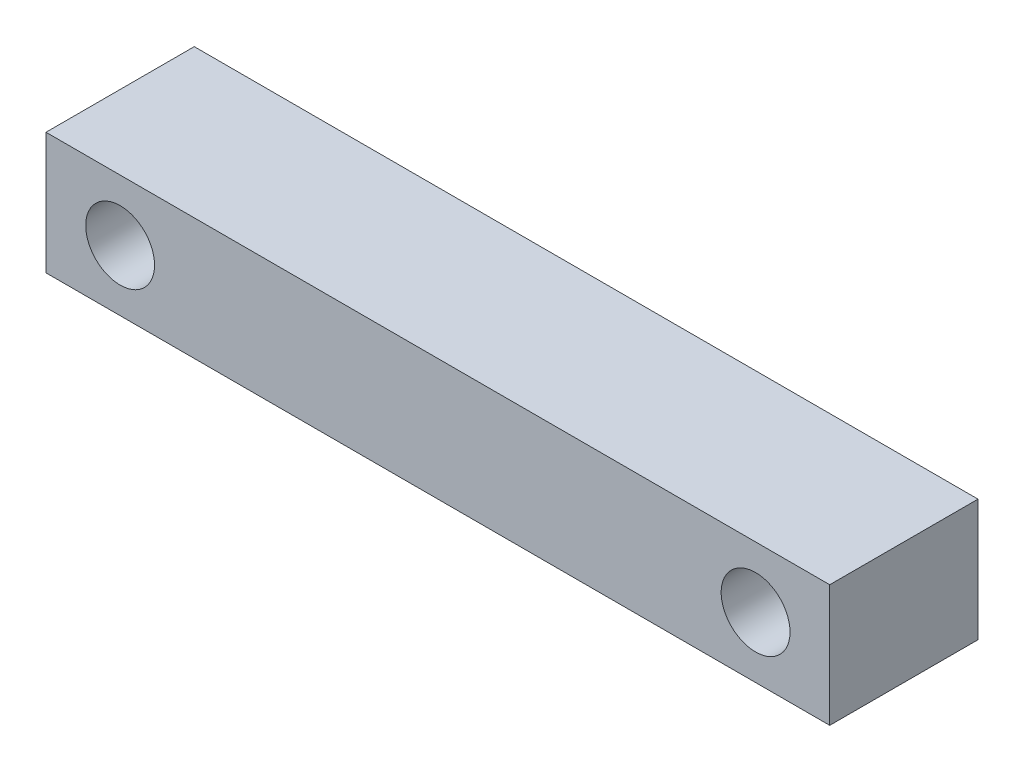
ISO-10303-21;
HEADER;
FILE_DESCRIPTION(('STEP AP214'),'2;1');
FILE_NAME('part.step','',(''),(''),'','','');
FILE_SCHEMA(('AUTOMOTIVE_DESIGN { 1 0 10303 214 1 1 1 1 }'));
ENDSEC;
DATA;
#1=APPLICATION_CONTEXT('core data for automotive mechanical design processes');
#2=APPLICATION_PROTOCOL_DEFINITION('international standard','automotive_design',2000,#1);
#3=PRODUCT_CONTEXT('',#1,'mechanical');
#4=PRODUCT('Part','Part','',(#3));
#5=PRODUCT_RELATED_PRODUCT_CATEGORY('part','',(#4));
#6=PRODUCT_DEFINITION_FORMATION('','',#4);
#7=PRODUCT_DEFINITION_CONTEXT('part definition',#1,'design');
#8=PRODUCT_DEFINITION('design','',#6,#7);
#9=PRODUCT_DEFINITION_SHAPE('','',#8);
#10=(LENGTH_UNIT() NAMED_UNIT(*) SI_UNIT(.MILLI.,.METRE.));
#11=(NAMED_UNIT(*) PLANE_ANGLE_UNIT() SI_UNIT($,.RADIAN.));
#12=(NAMED_UNIT(*) SI_UNIT($,.STERADIAN.) SOLID_ANGLE_UNIT());
#13=UNCERTAINTY_MEASURE_WITH_UNIT(LENGTH_MEASURE(1.E-05),#10,'distance_accuracy_value','');
#14=(GEOMETRIC_REPRESENTATION_CONTEXT(3) GLOBAL_UNCERTAINTY_ASSIGNED_CONTEXT((#13)) GLOBAL_UNIT_ASSIGNED_CONTEXT((#10,
#11,#12)) REPRESENTATION_CONTEXT('',''));
#15=CARTESIAN_POINT('',(0.,0.,0.));
#16=DIRECTION('',(0.,0.,1.));
#17=DIRECTION('',(1.,0.,0.));
#18=AXIS2_PLACEMENT_3D('',#15,#16,#17);
#19=CARTESIAN_POINT('',(-148.,-46.,56.));
#20=DIRECTION('',(0.,0.,1.));
#21=DIRECTION('',(1.,0.,0.));
#22=AXIS2_PLACEMENT_3D('',#19,#20,#21);
#23=PLANE('',#22);
#24=CARTESIAN_POINT('',(-120.,-23.,56.));
#25=DIRECTION('',(0.,0.,1.));
#26=DIRECTION('',(1.,0.,0.));
#27=AXIS2_PLACEMENT_3D('',#24,#25,#26);
#28=CIRCLE('',#27,13.);
#29=CARTESIAN_POINT('',(-107.,-23.,56.));
#30=VERTEX_POINT('',#29);
#31=EDGE_CURVE('E102',#30,#30,#28,.T.);
#32=ORIENTED_EDGE('',*,*,#31,.F.);
#33=EDGE_LOOP('',(#32));
#34=FACE_BOUND('',#33,.T.);
#35=DIRECTION('',(0.,-1.,0.));
#36=VECTOR('',#35,1.);
#37=CARTESIAN_POINT('',(-148.,0.,56.));
#38=LINE('',#37,#36);
#39=CARTESIAN_POINT('',(-148.,0.,56.));
#40=VERTEX_POINT('',#39);
#41=CARTESIAN_POINT('',(-148.,-46.,56.));
#42=VERTEX_POINT('',#41);
#43=EDGE_CURVE('E87',#40,#42,#38,.T.);
#44=ORIENTED_EDGE('',*,*,#43,.T.);
#45=DIRECTION('',(1.,0.,0.));
#46=VECTOR('',#45,1.);
#47=CARTESIAN_POINT('',(-148.,-46.,56.));
#48=LINE('',#47,#46);
#49=CARTESIAN_POINT('',(148.,-46.,56.));
#50=VERTEX_POINT('',#49);
#51=EDGE_CURVE('E82',#42,#50,#48,.T.);
#52=ORIENTED_EDGE('',*,*,#51,.T.);
#53=DIRECTION('',(0.,1.,0.));
#54=VECTOR('',#53,1.);
#55=CARTESIAN_POINT('',(148.,0.,56.));
#56=LINE('',#55,#54);
#57=CARTESIAN_POINT('',(148.,0.,56.));
#58=VERTEX_POINT('',#57);
#59=EDGE_CURVE('E85',#50,#58,#56,.T.);
#60=ORIENTED_EDGE('',*,*,#59,.T.);
#61=DIRECTION('',(-1.,0.,0.));
#62=VECTOR('',#61,1.);
#63=CARTESIAN_POINT('',(-148.,0.,56.));
#64=LINE('',#63,#62);
#65=EDGE_CURVE('E52',#58,#40,#64,.T.);
#66=ORIENTED_EDGE('',*,*,#65,.T.);
#67=EDGE_LOOP('',(#44,#52,#60,#66));
#68=FACE_BOUND('',#67,.T.);
#69=CARTESIAN_POINT('',(120.,-23.,56.));
#70=DIRECTION('',(0.,0.,1.));
#71=DIRECTION('',(1.,0.,0.));
#72=AXIS2_PLACEMENT_3D('',#69,#70,#71);
#73=CIRCLE('',#72,13.);
#74=CARTESIAN_POINT('',(133.,-23.,56.));
#75=VERTEX_POINT('',#74);
#76=EDGE_CURVE('E117',#75,#75,#73,.T.);
#77=ORIENTED_EDGE('',*,*,#76,.F.);
#78=EDGE_LOOP('',(#77));
#79=FACE_BOUND('',#78,.T.);
#80=ADVANCED_FACE('F35',(#34,#68,#79),#23,.T.);
#81=CARTESIAN_POINT('',(-148.,-46.,0.));
#82=DIRECTION('',(0.,0.,1.));
#83=DIRECTION('',(1.,0.,0.));
#84=AXIS2_PLACEMENT_3D('',#81,#82,#83);
#85=PLANE('',#84);
#86=CARTESIAN_POINT('',(-120.,-23.,0.));
#87=DIRECTION('',(0.,0.,1.));
#88=DIRECTION('',(1.,0.,0.));
#89=AXIS2_PLACEMENT_3D('',#86,#87,#88);
#90=CIRCLE('',#89,13.);
#91=CARTESIAN_POINT('',(-107.,-23.,0.));
#92=VERTEX_POINT('',#91);
#93=EDGE_CURVE('E114',#92,#92,#90,.T.);
#94=ORIENTED_EDGE('',*,*,#93,.T.);
#95=EDGE_LOOP('',(#94));
#96=FACE_BOUND('',#95,.T.);
#97=DIRECTION('',(0.,-1.,0.));
#98=VECTOR('',#97,1.);
#99=CARTESIAN_POINT('',(-148.,0.,0.));
#100=LINE('',#99,#98);
#101=CARTESIAN_POINT('',(-148.,0.,0.));
#102=VERTEX_POINT('',#101);
#103=CARTESIAN_POINT('',(-148.,-46.,0.));
#104=VERTEX_POINT('',#103);
#105=EDGE_CURVE('E99',#102,#104,#100,.T.);
#106=ORIENTED_EDGE('',*,*,#105,.F.);
#107=DIRECTION('',(-1.,0.,0.));
#108=VECTOR('',#107,1.);
#109=CARTESIAN_POINT('',(-148.,0.,0.));
#110=LINE('',#109,#108);
#111=CARTESIAN_POINT('',(148.,0.,0.));
#112=VERTEX_POINT('',#111);
#113=EDGE_CURVE('E75',#112,#102,#110,.T.);
#114=ORIENTED_EDGE('',*,*,#113,.F.);
#115=DIRECTION('',(0.,1.,0.));
#116=VECTOR('',#115,1.);
#117=CARTESIAN_POINT('',(148.,0.,0.));
#118=LINE('',#117,#116);
#119=CARTESIAN_POINT('',(148.,-46.,0.));
#120=VERTEX_POINT('',#119);
#121=EDGE_CURVE('E69',#120,#112,#118,.T.);
#122=ORIENTED_EDGE('',*,*,#121,.F.);
#123=DIRECTION('',(1.,0.,0.));
#124=VECTOR('',#123,1.);
#125=CARTESIAN_POINT('',(-148.,-46.,0.));
#126=LINE('',#125,#124);
#127=EDGE_CURVE('E91',#104,#120,#126,.T.);
#128=ORIENTED_EDGE('',*,*,#127,.F.);
#129=EDGE_LOOP('',(#106,#114,#122,#128));
#130=FACE_BOUND('',#129,.T.);
#131=CARTESIAN_POINT('',(120.,-23.,0.));
#132=DIRECTION('',(0.,0.,1.));
#133=DIRECTION('',(1.,0.,0.));
#134=AXIS2_PLACEMENT_3D('',#131,#132,#133);
#135=CIRCLE('',#134,13.);
#136=CARTESIAN_POINT('',(133.,-23.,0.));
#137=VERTEX_POINT('',#136);
#138=EDGE_CURVE('E120',#137,#137,#135,.T.);
#139=ORIENTED_EDGE('',*,*,#138,.T.);
#140=EDGE_LOOP('',(#139));
#141=FACE_BOUND('',#140,.T.);
#142=ADVANCED_FACE('F110',(#96,#130,#141),#85,.F.);
#143=CARTESIAN_POINT('',(-148.,0.,56.));
#144=DIRECTION('',(1.,0.,0.));
#145=DIRECTION('',(0.,0.,-1.));
#146=AXIS2_PLACEMENT_3D('',#143,#144,#145);
#147=PLANE('',#146);
#148=ORIENTED_EDGE('',*,*,#105,.T.);
#149=DIRECTION('',(0.,0.,-1.));
#150=VECTOR('',#149,1.);
#151=CARTESIAN_POINT('',(-148.,-46.,56.));
#152=LINE('',#151,#150);
#153=EDGE_CURVE('E11',#42,#104,#152,.T.);
#154=ORIENTED_EDGE('',*,*,#153,.F.);
#155=ORIENTED_EDGE('',*,*,#43,.F.);
#156=DIRECTION('',(0.,0.,-1.));
#157=VECTOR('',#156,1.);
#158=CARTESIAN_POINT('',(-148.,0.,56.));
#159=LINE('',#158,#157);
#160=EDGE_CURVE('E95',#40,#102,#159,.T.);
#161=ORIENTED_EDGE('',*,*,#160,.T.);
#162=EDGE_LOOP('',(#148,#154,#155,#161));
#163=FACE_BOUND('',#162,.T.);
#164=ADVANCED_FACE('F37',(#163),#147,.F.);
#165=CARTESIAN_POINT('',(-148.,-46.,56.));
#166=DIRECTION('',(0.,1.,0.));
#167=DIRECTION('',(0.,0.,1.));
#168=AXIS2_PLACEMENT_3D('',#165,#166,#167);
#169=PLANE('',#168);
#170=ORIENTED_EDGE('',*,*,#127,.T.);
#171=DIRECTION('',(0.,0.,-1.));
#172=VECTOR('',#171,1.);
#173=CARTESIAN_POINT('',(148.,-46.,56.));
#174=LINE('',#173,#172);
#175=EDGE_CURVE('E44',#50,#120,#174,.T.);
#176=ORIENTED_EDGE('',*,*,#175,.F.);
#177=ORIENTED_EDGE('',*,*,#51,.F.);
#178=ORIENTED_EDGE('',*,*,#153,.T.);
#179=EDGE_LOOP('',(#170,#176,#177,#178));
#180=FACE_BOUND('',#179,.T.);
#181=ADVANCED_FACE('F90',(#180),#169,.F.);
#182=CARTESIAN_POINT('',(148.,0.,56.));
#183=DIRECTION('',(-1.,0.,0.));
#184=DIRECTION('',(0.,0.,1.));
#185=AXIS2_PLACEMENT_3D('',#182,#183,#184);
#186=PLANE('',#185);
#187=ORIENTED_EDGE('',*,*,#121,.T.);
#188=DIRECTION('',(0.,0.,-1.));
#189=VECTOR('',#188,1.);
#190=CARTESIAN_POINT('',(148.,0.,56.));
#191=LINE('',#190,#189);
#192=EDGE_CURVE('E92',#58,#112,#191,.T.);
#193=ORIENTED_EDGE('',*,*,#192,.F.);
#194=ORIENTED_EDGE('',*,*,#59,.F.);
#195=ORIENTED_EDGE('',*,*,#175,.T.);
#196=EDGE_LOOP('',(#187,#193,#194,#195));
#197=FACE_BOUND('',#196,.T.);
#198=ADVANCED_FACE('F93',(#197),#186,.F.);
#199=CARTESIAN_POINT('',(-148.,0.,56.));
#200=DIRECTION('',(0.,-1.,0.));
#201=DIRECTION('',(0.,0.,-1.));
#202=AXIS2_PLACEMENT_3D('',#199,#200,#201);
#203=PLANE('',#202);
#204=ORIENTED_EDGE('',*,*,#113,.T.);
#205=ORIENTED_EDGE('',*,*,#160,.F.);
#206=ORIENTED_EDGE('',*,*,#65,.F.);
#207=ORIENTED_EDGE('',*,*,#192,.T.);
#208=EDGE_LOOP('',(#204,#205,#206,#207));
#209=FACE_BOUND('',#208,.T.);
#210=ADVANCED_FACE('F107',(#209),#203,.F.);
#211=CARTESIAN_POINT('',(-120.,-23.,56.));
#212=DIRECTION('',(0.,0.,-1.));
#213=DIRECTION('',(-1.,0.,0.));
#214=AXIS2_PLACEMENT_3D('',#211,#212,#213);
#215=CYLINDRICAL_SURFACE('',#214,13.);
#216=ORIENTED_EDGE('',*,*,#31,.T.);
#217=EDGE_LOOP('',(#216));
#218=FACE_BOUND('',#217,.T.);
#219=ORIENTED_EDGE('',*,*,#93,.F.);
#220=EDGE_LOOP('',(#219));
#221=FACE_BOUND('',#220,.T.);
#222=ADVANCED_FACE('F138',(#218,#221),#215,.F.);
#223=CARTESIAN_POINT('',(120.,-23.,56.));
#224=DIRECTION('',(0.,0.,-1.));
#225=DIRECTION('',(-1.,0.,0.));
#226=AXIS2_PLACEMENT_3D('',#223,#224,#225);
#227=CYLINDRICAL_SURFACE('',#226,13.);
#228=ORIENTED_EDGE('',*,*,#76,.T.);
#229=EDGE_LOOP('',(#228));
#230=FACE_BOUND('',#229,.T.);
#231=ORIENTED_EDGE('',*,*,#138,.F.);
#232=EDGE_LOOP('',(#231));
#233=FACE_BOUND('',#232,.T.);
#234=ADVANCED_FACE('F126',(#230,#233),#227,.F.);
#235=CLOSED_SHELL('',(#80,#142,#164,#181,#198,#210,#222,#234));
#236=MANIFOLD_SOLID_BREP('B2',#235);
#237=ADVANCED_BREP_SHAPE_REPRESENTATION('',(#18,#236),#14);
#238=SHAPE_DEFINITION_REPRESENTATION(#9,#237);
ENDSEC;
END-ISO-10303-21;
